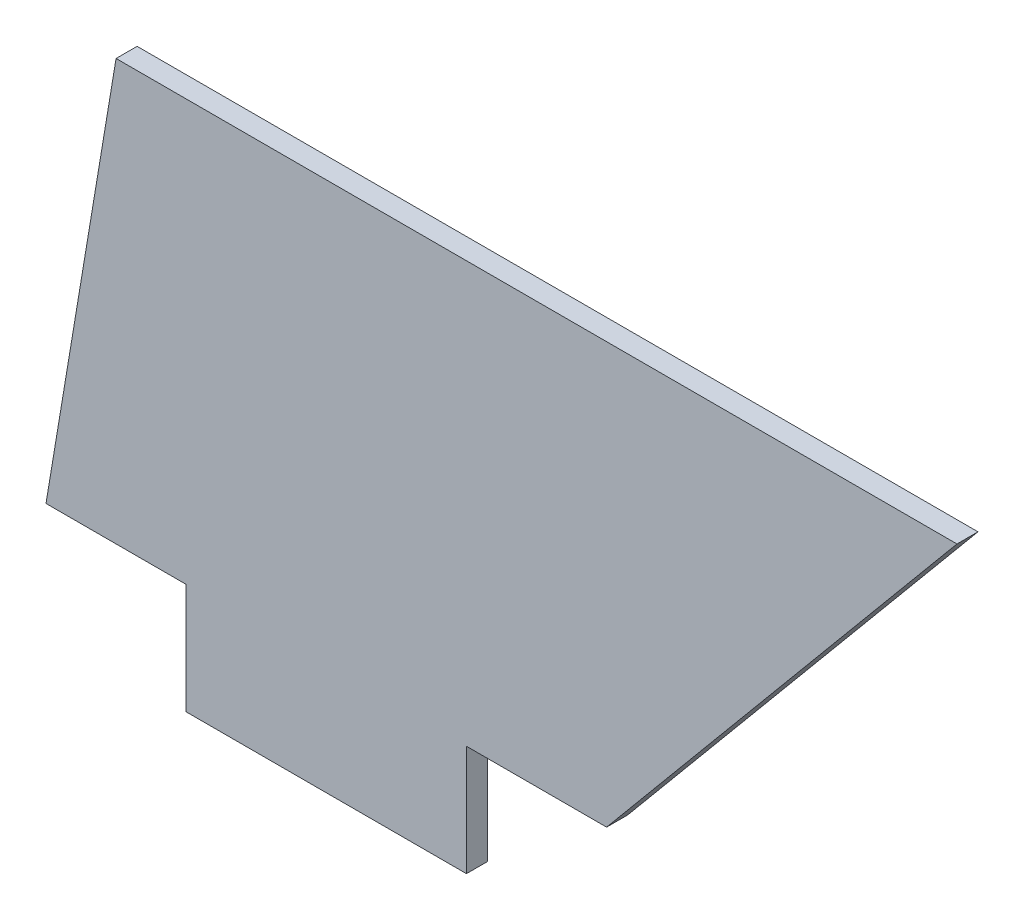
ISO-10303-21;
HEADER;
FILE_DESCRIPTION(('STEP AP214'),'2;1');
FILE_NAME('part.step','',(''),(''),'','','');
FILE_SCHEMA(('AUTOMOTIVE_DESIGN { 1 0 10303 214 1 1 1 1 }'));
ENDSEC;
DATA;
#1=APPLICATION_CONTEXT('core data for automotive mechanical design processes');
#2=APPLICATION_PROTOCOL_DEFINITION('international standard','automotive_design',2000,#1);
#3=PRODUCT_CONTEXT('',#1,'mechanical');
#4=PRODUCT('Part','Part','',(#3));
#5=PRODUCT_RELATED_PRODUCT_CATEGORY('part','',(#4));
#6=PRODUCT_DEFINITION_FORMATION('','',#4);
#7=PRODUCT_DEFINITION_CONTEXT('part definition',#1,'design');
#8=PRODUCT_DEFINITION('design','',#6,#7);
#9=PRODUCT_DEFINITION_SHAPE('','',#8);
#10=(LENGTH_UNIT() NAMED_UNIT(*) SI_UNIT(.MILLI.,.METRE.));
#11=(NAMED_UNIT(*) PLANE_ANGLE_UNIT() SI_UNIT($,.RADIAN.));
#12=(NAMED_UNIT(*) SI_UNIT($,.STERADIAN.) SOLID_ANGLE_UNIT());
#13=UNCERTAINTY_MEASURE_WITH_UNIT(LENGTH_MEASURE(1.E-05),#10,'distance_accuracy_value','');
#14=(GEOMETRIC_REPRESENTATION_CONTEXT(3) GLOBAL_UNCERTAINTY_ASSIGNED_CONTEXT((#13)) GLOBAL_UNIT_ASSIGNED_CONTEXT((#10,
#11,#12)) REPRESENTATION_CONTEXT('',''));
#15=CARTESIAN_POINT('',(0.,0.,0.));
#16=DIRECTION('',(0.,0.,1.));
#17=DIRECTION('',(1.,0.,0.));
#18=AXIS2_PLACEMENT_3D('',#15,#16,#17);
#19=CARTESIAN_POINT('',(5.,30.,1.5));
#20=DIRECTION('',(0.986393923832144,-0.164398987305357,0.));
#21=DIRECTION('',(0.164398987305357,0.986393923832144,0.));
#22=AXIS2_PLACEMENT_3D('',#19,#20,#21);
#23=PLANE('',#22);
#24=DIRECTION('',(-0.164398987305357,-0.986393923832144,0.));
#25=VECTOR('',#24,1.);
#26=CARTESIAN_POINT('',(5.,30.,0.));
#27=LINE('',#26,#25);
#28=CARTESIAN_POINT('',(5.,30.,0.));
#29=VERTEX_POINT('',#28);
#30=CARTESIAN_POINT('',(0.,0.,0.));
#31=VERTEX_POINT('',#30);
#32=EDGE_CURVE('E129',#29,#31,#27,.T.);
#33=ORIENTED_EDGE('',*,*,#32,.T.);
#34=DIRECTION('',(0.,0.,-1.));
#35=VECTOR('',#34,1.);
#36=CARTESIAN_POINT('',(0.,0.,1.5));
#37=LINE('',#36,#35);
#38=CARTESIAN_POINT('',(0.,0.,1.5));
#39=VERTEX_POINT('',#38);
#40=EDGE_CURVE('E11',#39,#31,#37,.T.);
#41=ORIENTED_EDGE('',*,*,#40,.F.);
#42=DIRECTION('',(-0.164398987305357,-0.986393923832144,0.));
#43=VECTOR('',#42,1.);
#44=CARTESIAN_POINT('',(5.,30.,1.5));
#45=LINE('',#44,#43);
#46=CARTESIAN_POINT('',(5.,30.,1.5));
#47=VERTEX_POINT('',#46);
#48=EDGE_CURVE('E143',#47,#39,#45,.T.);
#49=ORIENTED_EDGE('',*,*,#48,.F.);
#50=DIRECTION('',(0.,0.,-1.));
#51=VECTOR('',#50,1.);
#52=CARTESIAN_POINT('',(5.,30.,1.5));
#53=LINE('',#52,#51);
#54=EDGE_CURVE('E125',#47,#29,#53,.T.);
#55=ORIENTED_EDGE('',*,*,#54,.T.);
#56=EDGE_LOOP('',(#33,#41,#49,#55));
#57=FACE_BOUND('',#56,.T.);
#58=ADVANCED_FACE('F33',(#57),#23,.F.);
#59=CARTESIAN_POINT('',(0.,0.,1.5));
#60=DIRECTION('',(0.,1.,0.));
#61=DIRECTION('',(0.,0.,1.));
#62=AXIS2_PLACEMENT_3D('',#59,#60,#61);
#63=PLANE('',#62);
#64=DIRECTION('',(1.,0.,0.));
#65=VECTOR('',#64,1.);
#66=CARTESIAN_POINT('',(0.,0.,0.));
#67=LINE('',#66,#65);
#68=CARTESIAN_POINT('',(10.,0.,0.));
#69=VERTEX_POINT('',#68);
#70=EDGE_CURVE('E132',#31,#69,#67,.T.);
#71=ORIENTED_EDGE('',*,*,#70,.T.);
#72=DIRECTION('',(0.,0.,-1.));
#73=VECTOR('',#72,1.);
#74=CARTESIAN_POINT('',(10.,0.,1.5));
#75=LINE('',#74,#73);
#76=CARTESIAN_POINT('',(10.,0.,1.5));
#77=VERTEX_POINT('',#76);
#78=EDGE_CURVE('E41',#77,#69,#75,.T.);
#79=ORIENTED_EDGE('',*,*,#78,.F.);
#80=DIRECTION('',(1.,0.,0.));
#81=VECTOR('',#80,1.);
#82=CARTESIAN_POINT('',(0.,0.,1.5));
#83=LINE('',#82,#81);
#84=EDGE_CURVE('E92',#39,#77,#83,.T.);
#85=ORIENTED_EDGE('',*,*,#84,.F.);
#86=ORIENTED_EDGE('',*,*,#40,.T.);
#87=EDGE_LOOP('',(#71,#79,#85,#86));
#88=FACE_BOUND('',#87,.T.);
#89=ADVANCED_FACE('F178',(#88),#63,.F.);
#90=CARTESIAN_POINT('',(10.,0.,1.5));
#91=DIRECTION('',(1.,0.,0.));
#92=DIRECTION('',(0.,1.,0.));
#93=AXIS2_PLACEMENT_3D('',#90,#91,#92);
#94=PLANE('',#93);
#95=DIRECTION('',(0.,-1.,0.));
#96=VECTOR('',#95,1.);
#97=CARTESIAN_POINT('',(10.,0.,0.));
#98=LINE('',#97,#96);
#99=CARTESIAN_POINT('',(10.,-7.875,0.));
#100=VERTEX_POINT('',#99);
#101=EDGE_CURVE('E134',#69,#100,#98,.T.);
#102=ORIENTED_EDGE('',*,*,#101,.T.);
#103=DIRECTION('',(0.,0.,-1.));
#104=VECTOR('',#103,1.);
#105=CARTESIAN_POINT('',(10.,-7.875,1.5));
#106=LINE('',#105,#104);
#107=CARTESIAN_POINT('',(10.,-7.875,1.5));
#108=VERTEX_POINT('',#107);
#109=EDGE_CURVE('E150',#108,#100,#106,.T.);
#110=ORIENTED_EDGE('',*,*,#109,.F.);
#111=DIRECTION('',(0.,-1.,0.));
#112=VECTOR('',#111,1.);
#113=CARTESIAN_POINT('',(10.,0.,1.5));
#114=LINE('',#113,#112);
#115=EDGE_CURVE('E158',#77,#108,#114,.T.);
#116=ORIENTED_EDGE('',*,*,#115,.F.);
#117=ORIENTED_EDGE('',*,*,#78,.T.);
#118=EDGE_LOOP('',(#102,#110,#116,#117));
#119=FACE_BOUND('',#118,.T.);
#120=ADVANCED_FACE('F156',(#119),#94,.F.);
#121=CARTESIAN_POINT('',(10.,-7.875,1.5));
#122=DIRECTION('',(0.,1.,0.));
#123=DIRECTION('',(0.,0.,1.));
#124=AXIS2_PLACEMENT_3D('',#121,#122,#123);
#125=PLANE('',#124);
#126=DIRECTION('',(1.,0.,0.));
#127=VECTOR('',#126,1.);
#128=CARTESIAN_POINT('',(10.,-7.875,0.));
#129=LINE('',#128,#127);
#130=CARTESIAN_POINT('',(30.,-7.875,0.));
#131=VERTEX_POINT('',#130);
#132=EDGE_CURVE('E136',#100,#131,#129,.T.);
#133=ORIENTED_EDGE('',*,*,#132,.T.);
#134=DIRECTION('',(0.,0.,-1.));
#135=VECTOR('',#134,1.);
#136=CARTESIAN_POINT('',(30.,-7.875,1.5));
#137=LINE('',#136,#135);
#138=CARTESIAN_POINT('',(30.,-7.875,1.5));
#139=VERTEX_POINT('',#138);
#140=EDGE_CURVE('E147',#139,#131,#137,.T.);
#141=ORIENTED_EDGE('',*,*,#140,.F.);
#142=DIRECTION('',(1.,0.,0.));
#143=VECTOR('',#142,1.);
#144=CARTESIAN_POINT('',(10.,-7.875,1.5));
#145=LINE('',#144,#143);
#146=EDGE_CURVE('E170',#108,#139,#145,.T.);
#147=ORIENTED_EDGE('',*,*,#146,.F.);
#148=ORIENTED_EDGE('',*,*,#109,.T.);
#149=EDGE_LOOP('',(#133,#141,#147,#148));
#150=FACE_BOUND('',#149,.T.);
#151=ADVANCED_FACE('F166',(#150),#125,.F.);
#152=CARTESIAN_POINT('',(30.,-7.875,1.5));
#153=DIRECTION('',(-1.,0.,0.));
#154=DIRECTION('',(0.,0.,1.));
#155=AXIS2_PLACEMENT_3D('',#152,#153,#154);
#156=PLANE('',#155);
#157=DIRECTION('',(0.,1.,0.));
#158=VECTOR('',#157,1.);
#159=CARTESIAN_POINT('',(30.,-7.875,0.));
#160=LINE('',#159,#158);
#161=CARTESIAN_POINT('',(30.,0.,0.));
#162=VERTEX_POINT('',#161);
#163=EDGE_CURVE('E138',#131,#162,#160,.T.);
#164=ORIENTED_EDGE('',*,*,#163,.T.);
#165=DIRECTION('',(0.,0.,-1.));
#166=VECTOR('',#165,1.);
#167=CARTESIAN_POINT('',(30.,0.,1.5));
#168=LINE('',#167,#166);
#169=CARTESIAN_POINT('',(30.,0.,1.5));
#170=VERTEX_POINT('',#169);
#171=EDGE_CURVE('E120',#170,#162,#168,.T.);
#172=ORIENTED_EDGE('',*,*,#171,.F.);
#173=DIRECTION('',(0.,1.,0.));
#174=VECTOR('',#173,1.);
#175=CARTESIAN_POINT('',(30.,-7.875,1.5));
#176=LINE('',#175,#174);
#177=EDGE_CURVE('E111',#139,#170,#176,.T.);
#178=ORIENTED_EDGE('',*,*,#177,.F.);
#179=ORIENTED_EDGE('',*,*,#140,.T.);
#180=EDGE_LOOP('',(#164,#172,#178,#179));
#181=FACE_BOUND('',#180,.T.);
#182=ADVANCED_FACE('F169',(#181),#156,.F.);
#183=CARTESIAN_POINT('',(30.,0.,1.5));
#184=DIRECTION('',(0.,1.,0.));
#185=DIRECTION('',(-1.,0.,0.));
#186=AXIS2_PLACEMENT_3D('',#183,#184,#185);
#187=PLANE('',#186);
#188=DIRECTION('',(1.,0.,0.));
#189=VECTOR('',#188,1.);
#190=CARTESIAN_POINT('',(30.,0.,0.));
#191=LINE('',#190,#189);
#192=CARTESIAN_POINT('',(40.,0.,0.));
#193=VERTEX_POINT('',#192);
#194=EDGE_CURVE('E119',#162,#193,#191,.T.);
#195=ORIENTED_EDGE('',*,*,#194,.T.);
#196=DIRECTION('',(0.,0.,-1.));
#197=VECTOR('',#196,1.);
#198=CARTESIAN_POINT('',(40.,0.,1.5));
#199=LINE('',#198,#197);
#200=CARTESIAN_POINT('',(40.,0.,1.5));
#201=VERTEX_POINT('',#200);
#202=EDGE_CURVE('E116',#201,#193,#199,.T.);
#203=ORIENTED_EDGE('',*,*,#202,.F.);
#204=DIRECTION('',(1.,0.,0.));
#205=VECTOR('',#204,1.);
#206=CARTESIAN_POINT('',(30.,0.,1.5));
#207=LINE('',#206,#205);
#208=EDGE_CURVE('E105',#170,#201,#207,.T.);
#209=ORIENTED_EDGE('',*,*,#208,.F.);
#210=ORIENTED_EDGE('',*,*,#171,.T.);
#211=EDGE_LOOP('',(#195,#203,#209,#210));
#212=FACE_BOUND('',#211,.T.);
#213=ADVANCED_FACE('F117',(#212),#187,.F.);
#214=CARTESIAN_POINT('',(40.,0.,1.5));
#215=DIRECTION('',(-0.768221279597376,0.64018439966448,0.));
#216=DIRECTION('',(-0.64018439966448,-0.768221279597376,0.));
#217=AXIS2_PLACEMENT_3D('',#214,#215,#216);
#218=PLANE('',#217);
#219=DIRECTION('',(0.64018439966448,0.768221279597376,0.));
#220=VECTOR('',#219,1.);
#221=CARTESIAN_POINT('',(40.,0.,0.));
#222=LINE('',#221,#220);
#223=CARTESIAN_POINT('',(65.,30.,0.));
#224=VERTEX_POINT('',#223);
#225=EDGE_CURVE('E78',#193,#224,#222,.T.);
#226=ORIENTED_EDGE('',*,*,#225,.T.);
#227=DIRECTION('',(0.,0.,-1.));
#228=VECTOR('',#227,1.);
#229=CARTESIAN_POINT('',(65.,30.,1.5));
#230=LINE('',#229,#228);
#231=CARTESIAN_POINT('',(65.,30.,1.5));
#232=VERTEX_POINT('',#231);
#233=EDGE_CURVE('E121',#232,#224,#230,.T.);
#234=ORIENTED_EDGE('',*,*,#233,.F.);
#235=DIRECTION('',(0.64018439966448,0.768221279597376,0.));
#236=VECTOR('',#235,1.);
#237=CARTESIAN_POINT('',(40.,0.,1.5));
#238=LINE('',#237,#236);
#239=EDGE_CURVE('E109',#201,#232,#238,.T.);
#240=ORIENTED_EDGE('',*,*,#239,.F.);
#241=ORIENTED_EDGE('',*,*,#202,.T.);
#242=EDGE_LOOP('',(#226,#234,#240,#241));
#243=FACE_BOUND('',#242,.T.);
#244=ADVANCED_FACE('F123',(#243),#218,.F.);
#245=CARTESIAN_POINT('',(65.,30.,1.5));
#246=DIRECTION('',(0.,-1.,0.));
#247=DIRECTION('',(1.,0.,0.));
#248=AXIS2_PLACEMENT_3D('',#245,#246,#247);
#249=PLANE('',#248);
#250=DIRECTION('',(-1.,0.,0.));
#251=VECTOR('',#250,1.);
#252=CARTESIAN_POINT('',(65.,30.,0.));
#253=LINE('',#252,#251);
#254=EDGE_CURVE('E84',#224,#29,#253,.T.);
#255=ORIENTED_EDGE('',*,*,#254,.T.);
#256=ORIENTED_EDGE('',*,*,#54,.F.);
#257=DIRECTION('',(-1.,0.,0.));
#258=VECTOR('',#257,1.);
#259=CARTESIAN_POINT('',(65.,30.,1.5));
#260=LINE('',#259,#258);
#261=EDGE_CURVE('E49',#232,#47,#260,.T.);
#262=ORIENTED_EDGE('',*,*,#261,.F.);
#263=ORIENTED_EDGE('',*,*,#233,.T.);
#264=EDGE_LOOP('',(#255,#256,#262,#263));
#265=FACE_BOUND('',#264,.T.);
#266=ADVANCED_FACE('F194',(#265),#249,.F.);
#267=CARTESIAN_POINT('',(0.,0.,1.5));
#268=DIRECTION('',(0.,0.,1.));
#269=DIRECTION('',(1.,0.,0.));
#270=AXIS2_PLACEMENT_3D('',#267,#268,#269);
#271=PLANE('',#270);
#272=ORIENTED_EDGE('',*,*,#48,.T.);
#273=ORIENTED_EDGE('',*,*,#84,.T.);
#274=ORIENTED_EDGE('',*,*,#115,.T.);
#275=ORIENTED_EDGE('',*,*,#146,.T.);
#276=ORIENTED_EDGE('',*,*,#177,.T.);
#277=ORIENTED_EDGE('',*,*,#208,.T.);
#278=ORIENTED_EDGE('',*,*,#239,.T.);
#279=ORIENTED_EDGE('',*,*,#261,.T.);
#280=EDGE_LOOP('',(#272,#273,#274,#275,#276,#277,#278,#279));
#281=FACE_BOUND('',#280,.T.);
#282=ADVANCED_FACE('F107',(#281),#271,.T.);
#283=CARTESIAN_POINT('',(0.,0.,0.));
#284=DIRECTION('',(0.,0.,1.));
#285=DIRECTION('',(1.,0.,0.));
#286=AXIS2_PLACEMENT_3D('',#283,#284,#285);
#287=PLANE('',#286);
#288=ORIENTED_EDGE('',*,*,#32,.F.);
#289=ORIENTED_EDGE('',*,*,#254,.F.);
#290=ORIENTED_EDGE('',*,*,#225,.F.);
#291=ORIENTED_EDGE('',*,*,#194,.F.);
#292=ORIENTED_EDGE('',*,*,#163,.F.);
#293=ORIENTED_EDGE('',*,*,#132,.F.);
#294=ORIENTED_EDGE('',*,*,#101,.F.);
#295=ORIENTED_EDGE('',*,*,#70,.F.);
#296=EDGE_LOOP('',(#288,#289,#290,#291,#292,#293,#294,#295));
#297=FACE_BOUND('',#296,.T.);
#298=ADVANCED_FACE('F162',(#297),#287,.F.);
#299=CLOSED_SHELL('',(#58,#89,#120,#151,#182,#213,#244,#266,#282,#298));
#300=MANIFOLD_SOLID_BREP('B2',#299);
#301=ADVANCED_BREP_SHAPE_REPRESENTATION('',(#18,#300),#14);
#302=SHAPE_DEFINITION_REPRESENTATION(#9,#301);
ENDSEC;
END-ISO-10303-21;
